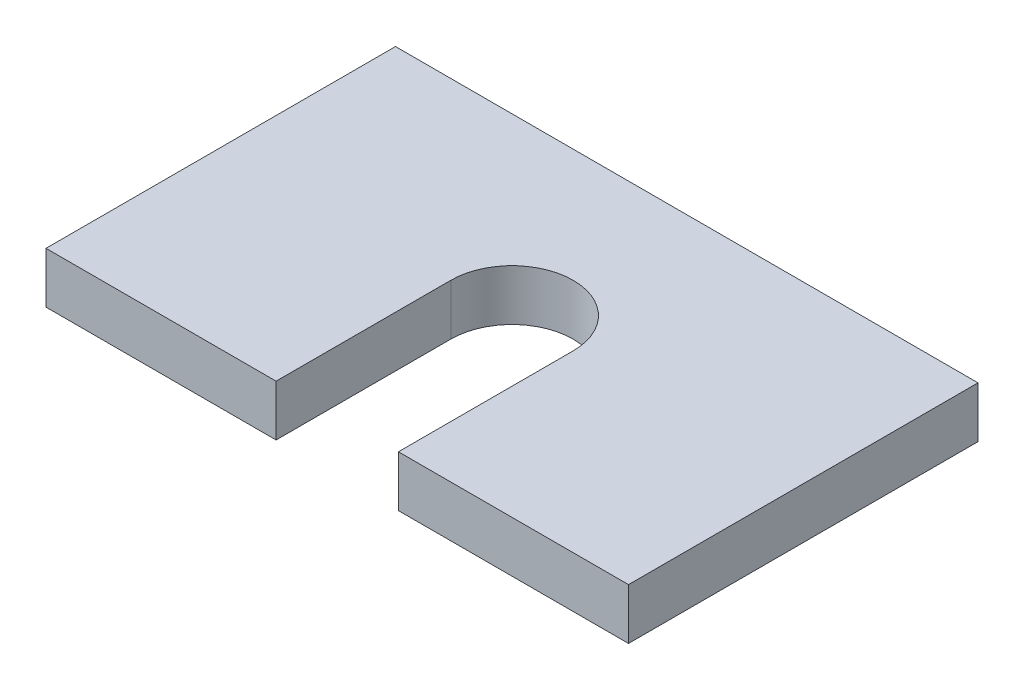
ISO-10303-21;
HEADER;
FILE_DESCRIPTION(('STEP AP214'),'2;1');
FILE_NAME('part.step','',(''),(''),'','','');
FILE_SCHEMA(('AUTOMOTIVE_DESIGN { 1 0 10303 214 1 1 1 1 }'));
ENDSEC;
DATA;
#1=APPLICATION_CONTEXT('core data for automotive mechanical design processes');
#2=APPLICATION_PROTOCOL_DEFINITION('international standard','automotive_design',2000,#1);
#3=PRODUCT_CONTEXT('',#1,'mechanical');
#4=PRODUCT('Part','Part','',(#3));
#5=PRODUCT_RELATED_PRODUCT_CATEGORY('part','',(#4));
#6=PRODUCT_DEFINITION_FORMATION('','',#4);
#7=PRODUCT_DEFINITION_CONTEXT('part definition',#1,'design');
#8=PRODUCT_DEFINITION('design','',#6,#7);
#9=PRODUCT_DEFINITION_SHAPE('','',#8);
#10=(LENGTH_UNIT() NAMED_UNIT(*) SI_UNIT(.MILLI.,.METRE.));
#11=(NAMED_UNIT(*) PLANE_ANGLE_UNIT() SI_UNIT($,.RADIAN.));
#12=(NAMED_UNIT(*) SI_UNIT($,.STERADIAN.) SOLID_ANGLE_UNIT());
#13=UNCERTAINTY_MEASURE_WITH_UNIT(LENGTH_MEASURE(1.E-05),#10,'distance_accuracy_value','');
#14=(GEOMETRIC_REPRESENTATION_CONTEXT(3) GLOBAL_UNCERTAINTY_ASSIGNED_CONTEXT((#13)) GLOBAL_UNIT_ASSIGNED_CONTEXT((#10,
#11,#12)) REPRESENTATION_CONTEXT('',''));
#15=CARTESIAN_POINT('',(0.,0.,0.));
#16=DIRECTION('',(0.,0.,1.));
#17=DIRECTION('',(1.,0.,0.));
#18=AXIS2_PLACEMENT_3D('',#15,#16,#17);
#19=CARTESIAN_POINT('',(0.,11.1125,0.));
#20=DIRECTION('',(0.,-1.,0.));
#21=DIRECTION('',(0.,0.,-1.));
#22=AXIS2_PLACEMENT_3D('',#19,#20,#21);
#23=CYLINDRICAL_SURFACE('',#22,13.335);
#24=CARTESIAN_POINT('',(0.,0.,0.));
#25=DIRECTION('',(0.,1.,0.));
#26=DIRECTION('',(0.,0.,1.));
#27=AXIS2_PLACEMENT_3D('',#24,#25,#26);
#28=CIRCLE('',#27,13.335);
#29=CARTESIAN_POINT('',(13.335,0.,0.));
#30=VERTEX_POINT('',#29);
#31=CARTESIAN_POINT('',(-13.335,0.,0.));
#32=VERTEX_POINT('',#31);
#33=EDGE_CURVE('E171',#30,#32,#28,.T.);
#34=ORIENTED_EDGE('',*,*,#33,.F.);
#35=DIRECTION('',(0.,-1.,0.));
#36=VECTOR('',#35,1.);
#37=CARTESIAN_POINT('',(13.335,11.1125,0.));
#38=LINE('',#37,#36);
#39=CARTESIAN_POINT('',(13.335,11.1125,0.));
#40=VERTEX_POINT('',#39);
#41=EDGE_CURVE('E11',#40,#30,#38,.T.);
#42=ORIENTED_EDGE('',*,*,#41,.F.);
#43=CARTESIAN_POINT('',(0.,11.1125,0.));
#44=DIRECTION('',(0.,1.,0.));
#45=DIRECTION('',(0.,0.,1.));
#46=AXIS2_PLACEMENT_3D('',#43,#44,#45);
#47=CIRCLE('',#46,13.335);
#48=CARTESIAN_POINT('',(-13.335,11.1125,0.));
#49=VERTEX_POINT('',#48);
#50=EDGE_CURVE('E143',#40,#49,#47,.T.);
#51=ORIENTED_EDGE('',*,*,#50,.T.);
#52=DIRECTION('',(0.,-1.,0.));
#53=VECTOR('',#52,1.);
#54=CARTESIAN_POINT('',(-13.335,11.1125,0.));
#55=LINE('',#54,#53);
#56=EDGE_CURVE('E57',#49,#32,#55,.T.);
#57=ORIENTED_EDGE('',*,*,#56,.T.);
#58=EDGE_LOOP('',(#34,#42,#51,#57));
#59=FACE_BOUND('',#58,.T.);
#60=ADVANCED_FACE('F41',(#59),#23,.F.);
#61=CARTESIAN_POINT('',(13.335,11.1125,0.));
#62=DIRECTION('',(1.,0.,0.));
#63=DIRECTION('',(0.,0.,-1.));
#64=AXIS2_PLACEMENT_3D('',#61,#62,#63);
#65=PLANE('',#64);
#66=DIRECTION('',(0.,0.,1.));
#67=VECTOR('',#66,1.);
#68=CARTESIAN_POINT('',(13.335,0.,0.));
#69=LINE('',#68,#67);
#70=CARTESIAN_POINT('',(13.335,0.,38.1));
#71=VERTEX_POINT('',#70);
#72=EDGE_CURVE('E169',#30,#71,#69,.T.);
#73=ORIENTED_EDGE('',*,*,#72,.T.);
#74=DIRECTION('',(0.,-1.,0.));
#75=VECTOR('',#74,1.);
#76=CARTESIAN_POINT('',(13.335,11.1125,38.1));
#77=LINE('',#76,#75);
#78=CARTESIAN_POINT('',(13.335,11.1125,38.1));
#79=VERTEX_POINT('',#78);
#80=EDGE_CURVE('E49',#79,#71,#77,.T.);
#81=ORIENTED_EDGE('',*,*,#80,.F.);
#82=DIRECTION('',(0.,0.,1.));
#83=VECTOR('',#82,1.);
#84=CARTESIAN_POINT('',(13.335,11.1125,0.));
#85=LINE('',#84,#83);
#86=EDGE_CURVE('E139',#40,#79,#85,.T.);
#87=ORIENTED_EDGE('',*,*,#86,.F.);
#88=ORIENTED_EDGE('',*,*,#41,.T.);
#89=EDGE_LOOP('',(#73,#81,#87,#88));
#90=FACE_BOUND('',#89,.T.);
#91=ADVANCED_FACE('F170',(#90),#65,.F.);
#92=CARTESIAN_POINT('',(0.,11.1125,38.1));
#93=DIRECTION('',(0.,0.,1.));
#94=DIRECTION('',(1.,0.,0.));
#95=AXIS2_PLACEMENT_3D('',#92,#93,#94);
#96=PLANE('',#95);
#97=DIRECTION('',(-1.,0.,0.));
#98=VECTOR('',#97,1.);
#99=CARTESIAN_POINT('',(0.,0.,38.1));
#100=LINE('',#99,#98);
#101=CARTESIAN_POINT('',(63.5,0.,38.1));
#102=VERTEX_POINT('',#101);
#103=EDGE_CURVE('E152',#102,#71,#100,.T.);
#104=ORIENTED_EDGE('',*,*,#103,.F.);
#105=DIRECTION('',(0.,-1.,0.));
#106=VECTOR('',#105,1.);
#107=CARTESIAN_POINT('',(63.5,11.1125,38.1));
#108=LINE('',#107,#106);
#109=CARTESIAN_POINT('',(63.5,11.1125,38.1));
#110=VERTEX_POINT('',#109);
#111=EDGE_CURVE('E161',#110,#102,#108,.T.);
#112=ORIENTED_EDGE('',*,*,#111,.F.);
#113=DIRECTION('',(-1.,0.,0.));
#114=VECTOR('',#113,1.);
#115=CARTESIAN_POINT('',(0.,11.1125,38.1));
#116=LINE('',#115,#114);
#117=EDGE_CURVE('E133',#110,#79,#116,.T.);
#118=ORIENTED_EDGE('',*,*,#117,.T.);
#119=ORIENTED_EDGE('',*,*,#80,.T.);
#120=EDGE_LOOP('',(#104,#112,#118,#119));
#121=FACE_BOUND('',#120,.T.);
#122=ADVANCED_FACE('F164',(#121),#96,.T.);
#123=CARTESIAN_POINT('',(63.5,11.1125,0.));
#124=DIRECTION('',(1.,0.,0.));
#125=DIRECTION('',(0.,0.,-1.));
#126=AXIS2_PLACEMENT_3D('',#123,#124,#125);
#127=PLANE('',#126);
#128=DIRECTION('',(0.,0.,1.));
#129=VECTOR('',#128,1.);
#130=CARTESIAN_POINT('',(63.5,0.,0.));
#131=LINE('',#130,#129);
#132=CARTESIAN_POINT('',(63.5,0.,-38.1));
#133=VERTEX_POINT('',#132);
#134=EDGE_CURVE('E176',#133,#102,#131,.T.);
#135=ORIENTED_EDGE('',*,*,#134,.F.);
#136=DIRECTION('',(0.,-1.,0.));
#137=VECTOR('',#136,1.);
#138=CARTESIAN_POINT('',(63.5,11.1125,-38.1));
#139=LINE('',#138,#137);
#140=CARTESIAN_POINT('',(63.5,11.1125,-38.1));
#141=VERTEX_POINT('',#140);
#142=EDGE_CURVE('E159',#141,#133,#139,.T.);
#143=ORIENTED_EDGE('',*,*,#142,.F.);
#144=DIRECTION('',(0.,0.,1.));
#145=VECTOR('',#144,1.);
#146=CARTESIAN_POINT('',(63.5,11.1125,0.));
#147=LINE('',#146,#145);
#148=EDGE_CURVE('E138',#141,#110,#147,.T.);
#149=ORIENTED_EDGE('',*,*,#148,.T.);
#150=ORIENTED_EDGE('',*,*,#111,.T.);
#151=EDGE_LOOP('',(#135,#143,#149,#150));
#152=FACE_BOUND('',#151,.T.);
#153=ADVANCED_FACE('F183',(#152),#127,.T.);
#154=CARTESIAN_POINT('',(0.,11.1125,-38.1));
#155=DIRECTION('',(0.,0.,1.));
#156=DIRECTION('',(1.,0.,0.));
#157=AXIS2_PLACEMENT_3D('',#154,#155,#156);
#158=PLANE('',#157);
#159=DIRECTION('',(-1.,0.,0.));
#160=VECTOR('',#159,1.);
#161=CARTESIAN_POINT('',(0.,0.,-38.1));
#162=LINE('',#161,#160);
#163=CARTESIAN_POINT('',(-63.5,0.,-38.1));
#164=VERTEX_POINT('',#163);
#165=EDGE_CURVE('E177',#133,#164,#162,.T.);
#166=ORIENTED_EDGE('',*,*,#165,.T.);
#167=DIRECTION('',(0.,-1.,0.));
#168=VECTOR('',#167,1.);
#169=CARTESIAN_POINT('',(-63.5,11.1125,-38.1));
#170=LINE('',#169,#168);
#171=CARTESIAN_POINT('',(-63.5,11.1125,-38.1));
#172=VERTEX_POINT('',#171);
#173=EDGE_CURVE('E128',#172,#164,#170,.T.);
#174=ORIENTED_EDGE('',*,*,#173,.F.);
#175=DIRECTION('',(-1.,0.,0.));
#176=VECTOR('',#175,1.);
#177=CARTESIAN_POINT('',(0.,11.1125,-38.1));
#178=LINE('',#177,#176);
#179=EDGE_CURVE('E116',#141,#172,#178,.T.);
#180=ORIENTED_EDGE('',*,*,#179,.F.);
#181=ORIENTED_EDGE('',*,*,#142,.T.);
#182=EDGE_LOOP('',(#166,#174,#180,#181));
#183=FACE_BOUND('',#182,.T.);
#184=ADVANCED_FACE('F181',(#183),#158,.F.);
#185=CARTESIAN_POINT('',(-63.5,11.1125,0.));
#186=DIRECTION('',(1.,0.,0.));
#187=DIRECTION('',(0.,0.,-1.));
#188=AXIS2_PLACEMENT_3D('',#185,#186,#187);
#189=PLANE('',#188);
#190=DIRECTION('',(0.,0.,1.));
#191=VECTOR('',#190,1.);
#192=CARTESIAN_POINT('',(-63.5,0.,0.));
#193=LINE('',#192,#191);
#194=CARTESIAN_POINT('',(-63.5,0.,38.1));
#195=VERTEX_POINT('',#194);
#196=EDGE_CURVE('E125',#164,#195,#193,.T.);
#197=ORIENTED_EDGE('',*,*,#196,.T.);
#198=DIRECTION('',(0.,-1.,0.));
#199=VECTOR('',#198,1.);
#200=CARTESIAN_POINT('',(-63.5,11.1125,38.1));
#201=LINE('',#200,#199);
#202=CARTESIAN_POINT('',(-63.5,11.1125,38.1));
#203=VERTEX_POINT('',#202);
#204=EDGE_CURVE('E122',#203,#195,#201,.T.);
#205=ORIENTED_EDGE('',*,*,#204,.F.);
#206=DIRECTION('',(0.,0.,1.));
#207=VECTOR('',#206,1.);
#208=CARTESIAN_POINT('',(-63.5,11.1125,0.));
#209=LINE('',#208,#207);
#210=EDGE_CURVE('E107',#172,#203,#209,.T.);
#211=ORIENTED_EDGE('',*,*,#210,.F.);
#212=ORIENTED_EDGE('',*,*,#173,.T.);
#213=EDGE_LOOP('',(#197,#205,#211,#212));
#214=FACE_BOUND('',#213,.T.);
#215=ADVANCED_FACE('F123',(#214),#189,.F.);
#216=CARTESIAN_POINT('',(-13.335,0.,38.1));
#217=VERTEX_POINT('',#216);
#218=EDGE_CURVE('E148',#217,#195,#100,.T.);
#219=ORIENTED_EDGE('',*,*,#218,.F.);
#220=DIRECTION('',(0.,-1.,0.));
#221=VECTOR('',#220,1.);
#222=CARTESIAN_POINT('',(-13.335,11.1125,38.1));
#223=LINE('',#222,#221);
#224=CARTESIAN_POINT('',(-13.335,11.1125,38.1));
#225=VERTEX_POINT('',#224);
#226=EDGE_CURVE('E82',#225,#217,#223,.T.);
#227=ORIENTED_EDGE('',*,*,#226,.F.);
#228=EDGE_CURVE('E113',#225,#203,#116,.T.);
#229=ORIENTED_EDGE('',*,*,#228,.T.);
#230=ORIENTED_EDGE('',*,*,#204,.T.);
#231=EDGE_LOOP('',(#219,#227,#229,#230));
#232=FACE_BOUND('',#231,.T.);
#233=ADVANCED_FACE('F130',(#232),#96,.T.);
#234=CARTESIAN_POINT('',(-13.335,11.1125,0.));
#235=DIRECTION('',(1.,0.,0.));
#236=DIRECTION('',(0.,0.,-1.));
#237=AXIS2_PLACEMENT_3D('',#234,#235,#236);
#238=PLANE('',#237);
#239=DIRECTION('',(0.,0.,1.));
#240=VECTOR('',#239,1.);
#241=CARTESIAN_POINT('',(-13.335,0.,0.));
#242=LINE('',#241,#240);
#243=EDGE_CURVE('E145',#32,#217,#242,.T.);
#244=ORIENTED_EDGE('',*,*,#243,.F.);
#245=ORIENTED_EDGE('',*,*,#56,.F.);
#246=DIRECTION('',(0.,0.,1.));
#247=VECTOR('',#246,1.);
#248=CARTESIAN_POINT('',(-13.335,11.1125,0.));
#249=LINE('',#248,#247);
#250=EDGE_CURVE('E131',#49,#225,#249,.T.);
#251=ORIENTED_EDGE('',*,*,#250,.T.);
#252=ORIENTED_EDGE('',*,*,#226,.T.);
#253=EDGE_LOOP('',(#244,#245,#251,#252));
#254=FACE_BOUND('',#253,.T.);
#255=ADVANCED_FACE('F185',(#254),#238,.T.);
#256=CARTESIAN_POINT('',(0.,11.1125,0.));
#257=DIRECTION('',(0.,1.,0.));
#258=DIRECTION('',(0.,0.,1.));
#259=AXIS2_PLACEMENT_3D('',#256,#257,#258);
#260=PLANE('',#259);
#261=ORIENTED_EDGE('',*,*,#50,.F.);
#262=ORIENTED_EDGE('',*,*,#86,.T.);
#263=ORIENTED_EDGE('',*,*,#117,.F.);
#264=ORIENTED_EDGE('',*,*,#148,.F.);
#265=ORIENTED_EDGE('',*,*,#179,.T.);
#266=ORIENTED_EDGE('',*,*,#210,.T.);
#267=ORIENTED_EDGE('',*,*,#228,.F.);
#268=ORIENTED_EDGE('',*,*,#250,.F.);
#269=EDGE_LOOP('',(#261,#262,#263,#264,#265,#266,#267,#268));
#270=FACE_BOUND('',#269,.T.);
#271=ADVANCED_FACE('F110',(#270),#260,.T.);
#272=CARTESIAN_POINT('',(0.,0.,0.));
#273=DIRECTION('',(0.,1.,0.));
#274=DIRECTION('',(0.,0.,1.));
#275=AXIS2_PLACEMENT_3D('',#272,#273,#274);
#276=PLANE('',#275);
#277=ORIENTED_EDGE('',*,*,#33,.T.);
#278=ORIENTED_EDGE('',*,*,#243,.T.);
#279=ORIENTED_EDGE('',*,*,#218,.T.);
#280=ORIENTED_EDGE('',*,*,#196,.F.);
#281=ORIENTED_EDGE('',*,*,#165,.F.);
#282=ORIENTED_EDGE('',*,*,#134,.T.);
#283=ORIENTED_EDGE('',*,*,#103,.T.);
#284=ORIENTED_EDGE('',*,*,#72,.F.);
#285=EDGE_LOOP('',(#277,#278,#279,#280,#281,#282,#283,#284));
#286=FACE_BOUND('',#285,.T.);
#287=ADVANCED_FACE('F173',(#286),#276,.F.);
#288=CLOSED_SHELL('',(#60,#91,#122,#153,#184,#215,#233,#255,#271,#287));
#289=MANIFOLD_SOLID_BREP('B2',#288);
#290=ADVANCED_BREP_SHAPE_REPRESENTATION('',(#18,#289),#14);
#291=SHAPE_DEFINITION_REPRESENTATION(#9,#290);
ENDSEC;
END-ISO-10303-21;
